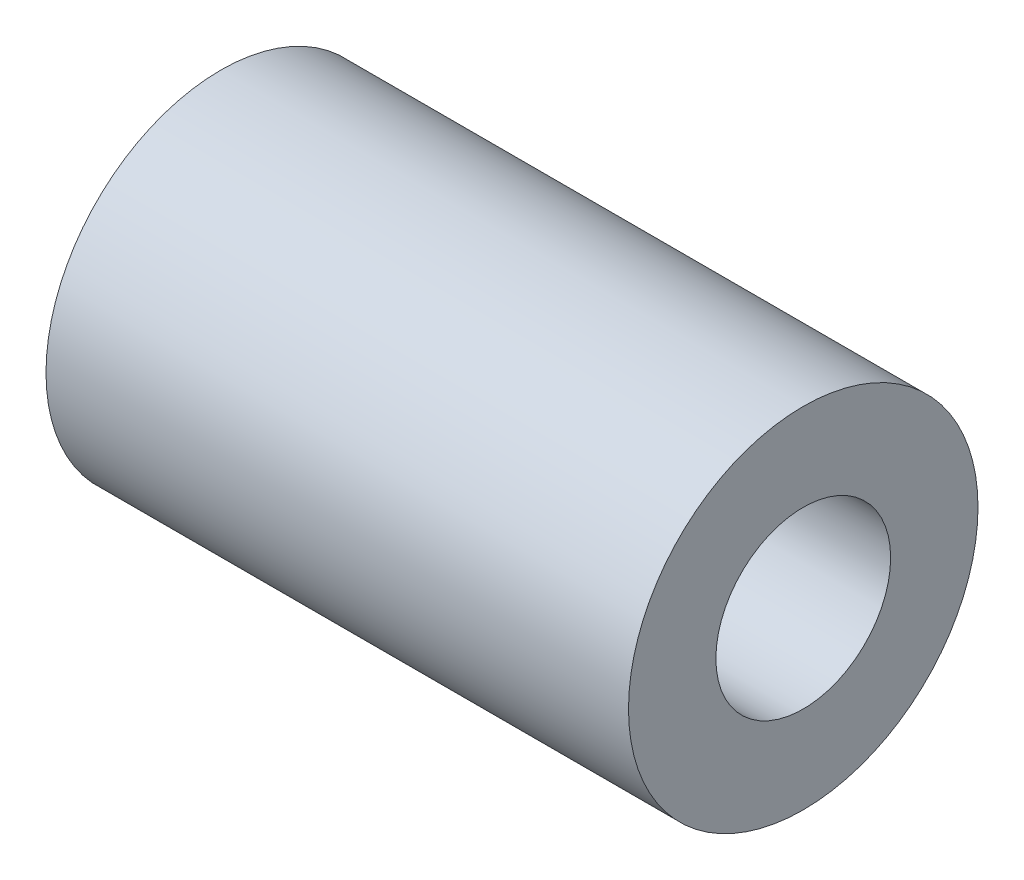
ISO-10303-21;
HEADER;
FILE_DESCRIPTION(('STEP AP214'),'2;1');
FILE_NAME('part.step','',(''),(''),'','','');
FILE_SCHEMA(('AUTOMOTIVE_DESIGN { 1 0 10303 214 1 1 1 1 }'));
ENDSEC;
DATA;
#1=APPLICATION_CONTEXT('core data for automotive mechanical design processes');
#2=APPLICATION_PROTOCOL_DEFINITION('international standard','automotive_design',2000,#1);
#3=PRODUCT_CONTEXT('',#1,'mechanical');
#4=PRODUCT('Part','Part','',(#3));
#5=PRODUCT_RELATED_PRODUCT_CATEGORY('part','',(#4));
#6=PRODUCT_DEFINITION_FORMATION('','',#4);
#7=PRODUCT_DEFINITION_CONTEXT('part definition',#1,'design');
#8=PRODUCT_DEFINITION('design','',#6,#7);
#9=PRODUCT_DEFINITION_SHAPE('','',#8);
#10=(LENGTH_UNIT() NAMED_UNIT(*) SI_UNIT(.MILLI.,.METRE.));
#11=(NAMED_UNIT(*) PLANE_ANGLE_UNIT() SI_UNIT($,.RADIAN.));
#12=(NAMED_UNIT(*) SI_UNIT($,.STERADIAN.) SOLID_ANGLE_UNIT());
#13=UNCERTAINTY_MEASURE_WITH_UNIT(LENGTH_MEASURE(1.E-05),#10,'distance_accuracy_value','');
#14=(GEOMETRIC_REPRESENTATION_CONTEXT(3) GLOBAL_UNCERTAINTY_ASSIGNED_CONTEXT((#13)) GLOBAL_UNIT_ASSIGNED_CONTEXT((#10,
#11,#12)) REPRESENTATION_CONTEXT('',''));
#15=CARTESIAN_POINT('',(0.,0.,0.));
#16=DIRECTION('',(0.,0.,1.));
#17=DIRECTION('',(1.,0.,0.));
#18=AXIS2_PLACEMENT_3D('',#15,#16,#17);
#19=CARTESIAN_POINT('',(376.394941120642,43.3157017452683,-226.556360518351));
#20=DIRECTION('',(-1.,0.,0.));
#21=DIRECTION('',(0.,0.,1.));
#22=AXIS2_PLACEMENT_3D('',#19,#20,#21);
#23=CYLINDRICAL_SURFACE('',#22,1.5);
#24=CARTESIAN_POINT('',(363.894917120642,43.3157017452683,-226.556360518351));
#25=DIRECTION('',(-1.,0.,0.));
#26=DIRECTION('',(0.,0.,1.));
#27=AXIS2_PLACEMENT_3D('',#24,#25,#26);
#28=CIRCLE('',#27,1.5);
#29=CARTESIAN_POINT('',(363.894917120642,43.3157017452683,-225.056360518351));
#30=VERTEX_POINT('',#29);
#31=EDGE_CURVE('E27',#30,#30,#28,.F.);
#32=ORIENTED_EDGE('',*,*,#31,.F.);
#33=EDGE_LOOP('',(#32));
#34=FACE_BOUND('',#33,.T.);
#35=CARTESIAN_POINT('',(373.894917120642,43.3157017452683,-226.556360518351));
#36=DIRECTION('',(-1.,0.,0.));
#37=DIRECTION('',(0.,0.,1.));
#38=AXIS2_PLACEMENT_3D('',#35,#36,#37);
#39=CIRCLE('',#38,1.5);
#40=CARTESIAN_POINT('',(373.894917120642,43.3157017452683,-225.056360518351));
#41=VERTEX_POINT('',#40);
#42=EDGE_CURVE('E18',#41,#41,#39,.F.);
#43=ORIENTED_EDGE('',*,*,#42,.T.);
#44=EDGE_LOOP('',(#43));
#45=FACE_BOUND('',#44,.T.);
#46=ADVANCED_FACE('F15',(#34,#45),#23,.F.);
#47=CARTESIAN_POINT('',(373.894917120642,17.210842172948,-244.757061419668));
#48=DIRECTION('',(-1.,0.,0.));
#49=DIRECTION('',(0.,0.,1.));
#50=AXIS2_PLACEMENT_3D('',#47,#48,#49);
#51=PLANE('',#50);
#52=ORIENTED_EDGE('',*,*,#42,.F.);
#53=EDGE_LOOP('',(#52));
#54=FACE_BOUND('',#53,.T.);
#55=CARTESIAN_POINT('',(373.894917120642,43.3157017452683,-226.556360518351));
#56=DIRECTION('',(-1.,0.,0.));
#57=DIRECTION('',(0.,0.,1.));
#58=AXIS2_PLACEMENT_3D('',#55,#56,#57);
#59=CIRCLE('',#58,3.);
#60=CARTESIAN_POINT('',(373.894917120642,43.3157017452683,-223.556360518351));
#61=VERTEX_POINT('',#60);
#62=EDGE_CURVE('E22',#61,#61,#59,.T.);
#63=ORIENTED_EDGE('',*,*,#62,.F.);
#64=EDGE_LOOP('',(#63));
#65=FACE_BOUND('',#64,.T.);
#66=ADVANCED_FACE('F36',(#54,#65),#51,.F.);
#67=CARTESIAN_POINT('',(363.894917120642,17.210842172948,-244.757061419668));
#68=DIRECTION('',(-1.,0.,0.));
#69=DIRECTION('',(0.,0.,1.));
#70=AXIS2_PLACEMENT_3D('',#67,#68,#69);
#71=PLANE('',#70);
#72=CARTESIAN_POINT('',(363.894917120642,43.3157017452683,-226.556360518351));
#73=DIRECTION('',(-1.,0.,0.));
#74=DIRECTION('',(0.,0.,1.));
#75=AXIS2_PLACEMENT_3D('',#72,#73,#74);
#76=CIRCLE('',#75,3.);
#77=CARTESIAN_POINT('',(363.894917120642,43.3157017452683,-223.556360518351));
#78=VERTEX_POINT('',#77);
#79=EDGE_CURVE('E10',#78,#78,#76,.F.);
#80=ORIENTED_EDGE('',*,*,#79,.F.);
#81=EDGE_LOOP('',(#80));
#82=FACE_BOUND('',#81,.T.);
#83=ORIENTED_EDGE('',*,*,#31,.T.);
#84=EDGE_LOOP('',(#83));
#85=FACE_BOUND('',#84,.T.);
#86=ADVANCED_FACE('F39',(#82,#85),#71,.T.);
#87=CARTESIAN_POINT('',(363.894917120642,43.3157017452683,-226.556360518351));
#88=DIRECTION('',(-1.,0.,0.));
#89=DIRECTION('',(0.,0.,1.));
#90=AXIS2_PLACEMENT_3D('',#87,#88,#89);
#91=CYLINDRICAL_SURFACE('',#90,3.);
#92=ORIENTED_EDGE('',*,*,#79,.T.);
#93=EDGE_LOOP('',(#92));
#94=FACE_BOUND('',#93,.T.);
#95=ORIENTED_EDGE('',*,*,#62,.T.);
#96=EDGE_LOOP('',(#95));
#97=FACE_BOUND('',#96,.T.);
#98=ADVANCED_FACE('F42',(#94,#97),#91,.T.);
#99=CLOSED_SHELL('',(#46,#66,#86,#98));
#100=MANIFOLD_SOLID_BREP('B1',#99);
#101=ADVANCED_BREP_SHAPE_REPRESENTATION('',(#18,#100),#14);
#102=SHAPE_DEFINITION_REPRESENTATION(#9,#101);
ENDSEC;
END-ISO-10303-21;
